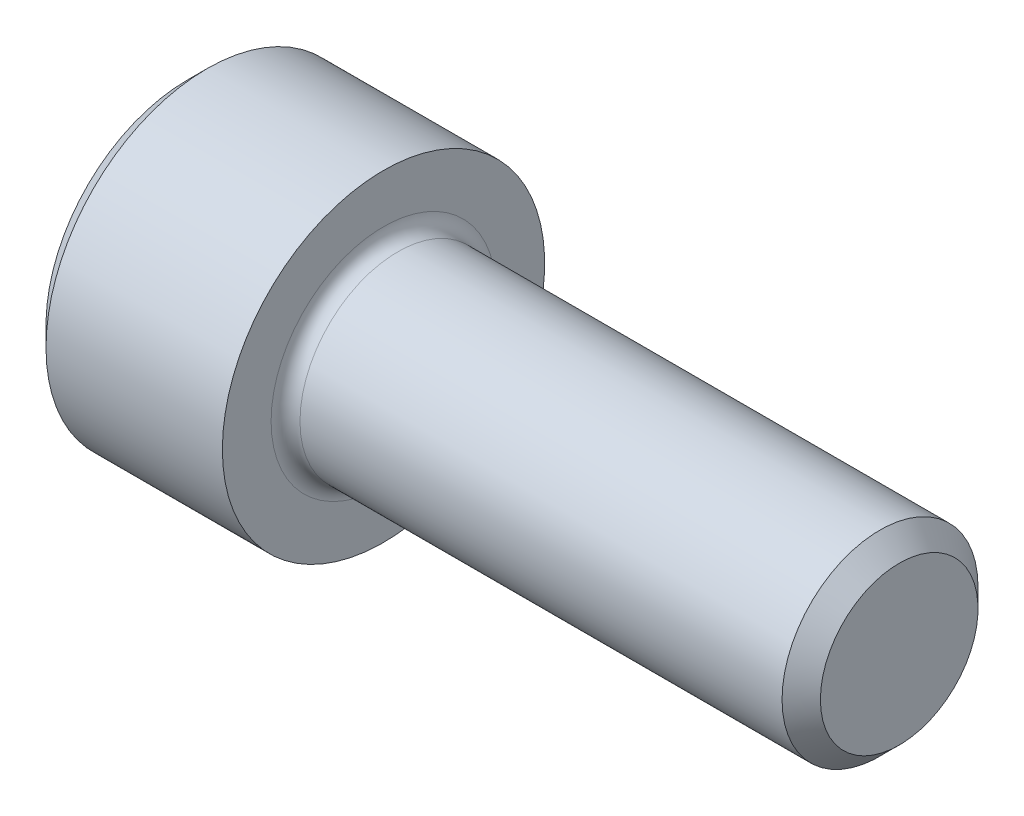
ISO-10303-21;
HEADER;
FILE_DESCRIPTION(('STEP AP214'),'2;1');
FILE_NAME('part.step','',(''),(''),'','','');
FILE_SCHEMA(('AUTOMOTIVE_DESIGN { 1 0 10303 214 1 1 1 1 }'));
ENDSEC;
DATA;
#1=APPLICATION_CONTEXT('core data for automotive mechanical design processes');
#2=APPLICATION_PROTOCOL_DEFINITION('international standard','automotive_design',2000,#1);
#3=PRODUCT_CONTEXT('',#1,'mechanical');
#4=PRODUCT('Part','Part','',(#3));
#5=PRODUCT_RELATED_PRODUCT_CATEGORY('part','',(#4));
#6=PRODUCT_DEFINITION_FORMATION('','',#4);
#7=PRODUCT_DEFINITION_CONTEXT('part definition',#1,'design');
#8=PRODUCT_DEFINITION('design','',#6,#7);
#9=PRODUCT_DEFINITION_SHAPE('','',#8);
#10=(LENGTH_UNIT() NAMED_UNIT(*) SI_UNIT(.MILLI.,.METRE.));
#11=(NAMED_UNIT(*) PLANE_ANGLE_UNIT() SI_UNIT($,.RADIAN.));
#12=(NAMED_UNIT(*) SI_UNIT($,.STERADIAN.) SOLID_ANGLE_UNIT());
#13=UNCERTAINTY_MEASURE_WITH_UNIT(LENGTH_MEASURE(1.E-05),#10,'distance_accuracy_value','');
#14=(GEOMETRIC_REPRESENTATION_CONTEXT(3) GLOBAL_UNCERTAINTY_ASSIGNED_CONTEXT((#13)) GLOBAL_UNIT_ASSIGNED_CONTEXT((#10,
#11,#12)) REPRESENTATION_CONTEXT('',''));
#15=CARTESIAN_POINT('',(0.,0.,0.));
#16=DIRECTION('',(0.,0.,1.));
#17=DIRECTION('',(1.,0.,0.));
#18=AXIS2_PLACEMENT_3D('',#15,#16,#17);
#19=CARTESIAN_POINT('',(2.286,1.14604605784411,1.98501));
#20=DIRECTION('',(-1.,0.,0.));
#21=DIRECTION('',(0.,0.,1.));
#22=AXIS2_PLACEMENT_3D('',#19,#20,#21);
#23=PLANE('',#22);
#24=DIRECTION('',(0.,0.500000000000001,0.866025403784438));
#25=VECTOR('',#24,1.);
#26=CARTESIAN_POINT('',(2.286,-1.71906908676614,0.992505));
#27=LINE('',#26,#25);
#28=CARTESIAN_POINT('',(2.2859999999804,-1.71906908679011,0.992505000013839));
#29=VERTEX_POINT('',#28);
#30=CARTESIAN_POINT('',(2.286,-1.14604605784409,1.98501));
#31=VERTEX_POINT('',#30);
#32=EDGE_CURVE('E108',#29,#31,#27,.T.);
#33=ORIENTED_EDGE('',*,*,#32,.T.);
#34=DIRECTION('',(0.,1.,0.));
#35=VECTOR('',#34,1.);
#36=CARTESIAN_POINT('',(2.286,1.14604605784411,1.98501));
#37=LINE('',#36,#35);
#38=CARTESIAN_POINT('',(2.28599999998701,0.,1.98501000001309));
#39=VERTEX_POINT('',#38);
#40=EDGE_CURVE('E103',#31,#39,#37,.T.);
#41=ORIENTED_EDGE('',*,*,#40,.T.);
#42=CARTESIAN_POINT('',(2.2859999999608,0.,0.));
#43=DIRECTION('',(-1.,0.,0.));
#44=DIRECTION('',(0.,0.,1.));
#45=AXIS2_PLACEMENT_3D('',#42,#43,#44);
#46=CIRCLE('',#45,1.98501000005535);
#47=EDGE_CURVE('E105',#39,#29,#46,.F.);
#48=ORIENTED_EDGE('',*,*,#47,.T.);
#49=EDGE_LOOP('',(#33,#41,#48));
#50=FACE_BOUND('',#49,.T.);
#51=ADVANCED_FACE('F24',(#50),#23,.T.);
#52=CARTESIAN_POINT('',(2.286,1.14604605784411,1.98501));
#53=DIRECTION('',(-1.,0.,0.));
#54=DIRECTION('',(0.,0.,1.));
#55=AXIS2_PLACEMENT_3D('',#52,#53,#54);
#56=PLANE('',#55);
#57=DIRECTION('',(0.,-0.499999999999998,0.86602540378444));
#58=VECTOR('',#57,1.);
#59=CARTESIAN_POINT('',(2.286,-1.71906908676615,-0.992504999999996));
#60=LINE('',#59,#58);
#61=CARTESIAN_POINT('',(2.2859999999804,-1.71906908679012,-0.992505000013836));
#62=VERTEX_POINT('',#61);
#63=CARTESIAN_POINT('',(2.286,-2.29209211568819,0.));
#64=VERTEX_POINT('',#63);
#65=EDGE_CURVE('E112',#62,#64,#60,.T.);
#66=ORIENTED_EDGE('',*,*,#65,.T.);
#67=DIRECTION('',(0.,0.500000000000001,0.866025403784438));
#68=VECTOR('',#67,1.);
#69=CARTESIAN_POINT('',(2.286,-2.29209211568819,0.));
#70=LINE('',#69,#68);
#71=EDGE_CURVE('E179',#64,#29,#70,.T.);
#72=ORIENTED_EDGE('',*,*,#71,.T.);
#73=CARTESIAN_POINT('',(2.2859999999608,0.,0.));
#74=DIRECTION('',(-1.,0.,0.));
#75=DIRECTION('',(0.,0.,1.));
#76=AXIS2_PLACEMENT_3D('',#73,#74,#75);
#77=CIRCLE('',#76,1.98501000005535);
#78=EDGE_CURVE('E124',#29,#62,#77,.F.);
#79=ORIENTED_EDGE('',*,*,#78,.T.);
#80=EDGE_LOOP('',(#66,#72,#79));
#81=FACE_BOUND('',#80,.T.);
#82=ADVANCED_FACE('F355',(#81),#56,.T.);
#83=CARTESIAN_POINT('',(2.286,1.14604605784411,1.98501));
#84=DIRECTION('',(-1.,0.,0.));
#85=DIRECTION('',(0.,0.,1.));
#86=AXIS2_PLACEMENT_3D('',#83,#84,#85);
#87=PLANE('',#86);
#88=DIRECTION('',(0.,1.,0.));
#89=VECTOR('',#88,1.);
#90=CARTESIAN_POINT('',(2.286,1.14604605784411,-1.98501));
#91=LINE('',#90,#89);
#92=CARTESIAN_POINT('',(2.28599999998701,0.,-1.98501000001309));
#93=VERTEX_POINT('',#92);
#94=CARTESIAN_POINT('',(2.286,-1.1460460578441,-1.98501));
#95=VERTEX_POINT('',#94);
#96=EDGE_CURVE('E174',#93,#95,#91,.F.);
#97=ORIENTED_EDGE('',*,*,#96,.T.);
#98=DIRECTION('',(0.,-0.499999999999999,0.866025403784439));
#99=VECTOR('',#98,1.);
#100=CARTESIAN_POINT('',(2.286,-1.1460460578441,-1.98501));
#101=LINE('',#100,#99);
#102=EDGE_CURVE('E169',#95,#62,#101,.T.);
#103=ORIENTED_EDGE('',*,*,#102,.T.);
#104=CARTESIAN_POINT('',(2.2859999999608,0.,0.));
#105=DIRECTION('',(-1.,0.,0.));
#106=DIRECTION('',(0.,0.,1.));
#107=AXIS2_PLACEMENT_3D('',#104,#105,#106);
#108=CIRCLE('',#107,1.98501000005535);
#109=EDGE_CURVE('E232',#62,#93,#108,.F.);
#110=ORIENTED_EDGE('',*,*,#109,.T.);
#111=EDGE_LOOP('',(#97,#103,#110));
#112=FACE_BOUND('',#111,.T.);
#113=ADVANCED_FACE('F352',(#112),#87,.T.);
#114=CARTESIAN_POINT('',(2.286,1.14604605784411,1.98501));
#115=DIRECTION('',(-1.,0.,0.));
#116=DIRECTION('',(0.,0.,1.));
#117=AXIS2_PLACEMENT_3D('',#114,#115,#116);
#118=PLANE('',#117);
#119=DIRECTION('',(0.,-0.500000000000001,-0.866025403784438));
#120=VECTOR('',#119,1.);
#121=CARTESIAN_POINT('',(2.286,1.71906908676615,-0.992505000000006));
#122=LINE('',#121,#120);
#123=CARTESIAN_POINT('',(2.2859999999804,1.71906908679012,-0.992505000013843));
#124=VERTEX_POINT('',#123);
#125=CARTESIAN_POINT('',(2.286,1.1460460578441,-1.98501));
#126=VERTEX_POINT('',#125);
#127=EDGE_CURVE('E164',#124,#126,#122,.T.);
#128=ORIENTED_EDGE('',*,*,#127,.T.);
#129=DIRECTION('',(0.,1.,0.));
#130=VECTOR('',#129,1.);
#131=CARTESIAN_POINT('',(2.286,1.14604605784411,-1.98501));
#132=LINE('',#131,#130);
#133=EDGE_CURVE('E159',#126,#93,#132,.F.);
#134=ORIENTED_EDGE('',*,*,#133,.T.);
#135=CARTESIAN_POINT('',(2.2859999999608,0.,0.));
#136=DIRECTION('',(-1.,0.,0.));
#137=DIRECTION('',(0.,0.,1.));
#138=AXIS2_PLACEMENT_3D('',#135,#136,#137);
#139=CIRCLE('',#138,1.98501000005535);
#140=EDGE_CURVE('E229',#93,#124,#139,.F.);
#141=ORIENTED_EDGE('',*,*,#140,.T.);
#142=EDGE_LOOP('',(#128,#134,#141));
#143=FACE_BOUND('',#142,.T.);
#144=ADVANCED_FACE('F348',(#143),#118,.T.);
#145=CARTESIAN_POINT('',(2.286,1.14604605784411,1.98501));
#146=DIRECTION('',(-1.,0.,0.));
#147=DIRECTION('',(0.,0.,1.));
#148=AXIS2_PLACEMENT_3D('',#145,#146,#147);
#149=PLANE('',#148);
#150=DIRECTION('',(0.,0.500000000000002,-0.866025403784437));
#151=VECTOR('',#150,1.);
#152=CARTESIAN_POINT('',(2.286,1.71906908676615,0.992504999999996));
#153=LINE('',#152,#151);
#154=CARTESIAN_POINT('',(2.2859999999804,1.71906908679012,0.992505000013835));
#155=VERTEX_POINT('',#154);
#156=CARTESIAN_POINT('',(2.286,2.2920921156882,0.));
#157=VERTEX_POINT('',#156);
#158=EDGE_CURVE('E154',#155,#157,#153,.T.);
#159=ORIENTED_EDGE('',*,*,#158,.T.);
#160=DIRECTION('',(0.,-0.500000000000002,-0.866025403784437));
#161=VECTOR('',#160,1.);
#162=CARTESIAN_POINT('',(2.286,2.2920921156882,0.));
#163=LINE('',#162,#161);
#164=EDGE_CURVE('E125',#157,#124,#163,.T.);
#165=ORIENTED_EDGE('',*,*,#164,.T.);
#166=CARTESIAN_POINT('',(2.2859999999608,0.,0.));
#167=DIRECTION('',(-1.,0.,0.));
#168=DIRECTION('',(0.,0.,1.));
#169=AXIS2_PLACEMENT_3D('',#166,#167,#168);
#170=CIRCLE('',#169,1.98501000005535);
#171=EDGE_CURVE('E132',#124,#155,#170,.F.);
#172=ORIENTED_EDGE('',*,*,#171,.T.);
#173=EDGE_LOOP('',(#159,#165,#172));
#174=FACE_BOUND('',#173,.T.);
#175=ADVANCED_FACE('F344',(#174),#149,.T.);
#176=CARTESIAN_POINT('',(2.28600000002643,0.,0.));
#177=DIRECTION('',(-1.,0.,0.));
#178=DIRECTION('',(0.,0.,1.));
#179=AXIS2_PLACEMENT_3D('',#176,#177,#178);
#180=CONICAL_SURFACE('',#179,1.98500999994167,1.04719755112655);
#181=CARTESIAN_POINT('',(3.43204605781011,0.,5.6843418860808E-11));
#182=VERTEX_POINT('',#181);
#183=VERTEX_LOOP('',#182);
#184=FACE_BOUND('',#183,.T.);
#185=ORIENTED_EDGE('',*,*,#47,.F.);
#186=CARTESIAN_POINT('',(2.2859999999608,0.,0.));
#187=DIRECTION('',(-1.,0.,0.));
#188=DIRECTION('',(0.,0.,1.));
#189=AXIS2_PLACEMENT_3D('',#186,#187,#188);
#190=CIRCLE('',#189,1.98501000005535);
#191=EDGE_CURVE('E120',#155,#39,#190,.F.);
#192=ORIENTED_EDGE('',*,*,#191,.F.);
#193=ORIENTED_EDGE('',*,*,#171,.F.);
#194=ORIENTED_EDGE('',*,*,#140,.F.);
#195=ORIENTED_EDGE('',*,*,#109,.F.);
#196=ORIENTED_EDGE('',*,*,#78,.F.);
#197=EDGE_LOOP('',(#185,#192,#193,#194,#195,#196));
#198=FACE_BOUND('',#197,.T.);
#199=ADVANCED_FACE('F118',(#184,#198),#180,.F.);
#200=CARTESIAN_POINT('',(2.286,1.14604605784411,1.98501));
#201=DIRECTION('',(-1.,0.,0.));
#202=DIRECTION('',(0.,0.,1.));
#203=AXIS2_PLACEMENT_3D('',#200,#201,#202);
#204=PLANE('',#203);
#205=DIRECTION('',(0.,-1.,0.));
#206=VECTOR('',#205,1.);
#207=CARTESIAN_POINT('',(2.286,-1.14604605784409,1.98501));
#208=LINE('',#207,#206);
#209=CARTESIAN_POINT('',(2.286,1.14604605784411,1.98501));
#210=VERTEX_POINT('',#209);
#211=EDGE_CURVE('E129',#39,#210,#208,.F.);
#212=ORIENTED_EDGE('',*,*,#211,.T.);
#213=DIRECTION('',(0.,0.499999999999998,-0.86602540378444));
#214=VECTOR('',#213,1.);
#215=CARTESIAN_POINT('',(2.286,2.2920921156882,0.));
#216=LINE('',#215,#214);
#217=EDGE_CURVE('E131',#155,#210,#216,.F.);
#218=ORIENTED_EDGE('',*,*,#217,.F.);
#219=ORIENTED_EDGE('',*,*,#191,.T.);
#220=EDGE_LOOP('',(#212,#218,#219));
#221=FACE_BOUND('',#220,.T.);
#222=ADVANCED_FACE('F128',(#221),#204,.T.);
#223=CARTESIAN_POINT('',(2.286,2.2920921156882,0.));
#224=DIRECTION('',(0.,-0.86602540378444,-0.499999999999998));
#225=DIRECTION('',(0.,0.499999999999998,-0.86602540378444));
#226=AXIS2_PLACEMENT_3D('',#223,#224,#225);
#227=PLANE('',#226);
#228=ORIENTED_EDGE('',*,*,#217,.T.);
#229=DIRECTION('',(1.,0.,0.));
#230=VECTOR('',#229,1.);
#231=CARTESIAN_POINT('',(2.286,1.14604605784411,1.98501));
#232=LINE('',#231,#230);
#233=CARTESIAN_POINT('',(0.,1.14604605784411,1.98501));
#234=VERTEX_POINT('',#233);
#235=EDGE_CURVE('E137',#210,#234,#232,.F.);
#236=ORIENTED_EDGE('',*,*,#235,.T.);
#237=DIRECTION('',(0.,-0.499999999999998,0.86602540378444));
#238=VECTOR('',#237,1.);
#239=CARTESIAN_POINT('',(0.,2.2920921156882,0.));
#240=LINE('',#239,#238);
#241=CARTESIAN_POINT('',(0.,2.2920921156882,0.));
#242=VERTEX_POINT('',#241);
#243=EDGE_CURVE('E144',#242,#234,#240,.T.);
#244=ORIENTED_EDGE('',*,*,#243,.F.);
#245=DIRECTION('',(1.,0.,0.));
#246=VECTOR('',#245,1.);
#247=CARTESIAN_POINT('',(2.286,2.2920921156882,0.));
#248=LINE('',#247,#246);
#249=EDGE_CURVE('E194',#242,#157,#248,.T.);
#250=ORIENTED_EDGE('',*,*,#249,.T.);
#251=ORIENTED_EDGE('',*,*,#158,.F.);
#252=EDGE_LOOP('',(#228,#236,#244,#250,#251));
#253=FACE_BOUND('',#252,.T.);
#254=ADVANCED_FACE('F336',(#253),#227,.T.);
#255=CARTESIAN_POINT('',(2.286,-1.14604605784409,1.98501));
#256=DIRECTION('',(0.,0.,1.));
#257=DIRECTION('',(0.,-1.,0.));
#258=AXIS2_PLACEMENT_3D('',#255,#256,#257);
#259=PLANE('',#258);
#260=ORIENTED_EDGE('',*,*,#235,.F.);
#261=ORIENTED_EDGE('',*,*,#211,.F.);
#262=ORIENTED_EDGE('',*,*,#40,.F.);
#263=DIRECTION('',(1.,0.,0.));
#264=VECTOR('',#263,1.);
#265=CARTESIAN_POINT('',(2.286,-1.14604605784409,1.98501));
#266=LINE('',#265,#264);
#267=CARTESIAN_POINT('',(0.,-1.14604605784409,1.98501));
#268=VERTEX_POINT('',#267);
#269=EDGE_CURVE('E139',#268,#31,#266,.T.);
#270=ORIENTED_EDGE('',*,*,#269,.F.);
#271=DIRECTION('',(0.,1.,0.));
#272=VECTOR('',#271,1.);
#273=CARTESIAN_POINT('',(0.,0.,1.98501));
#274=LINE('',#273,#272);
#275=EDGE_CURVE('E371',#234,#268,#274,.F.);
#276=ORIENTED_EDGE('',*,*,#275,.F.);
#277=EDGE_LOOP('',(#260,#261,#262,#270,#276));
#278=FACE_BOUND('',#277,.T.);
#279=ADVANCED_FACE('F135',(#278),#259,.F.);
#280=CARTESIAN_POINT('',(2.286,-1.14604605784409,1.98501));
#281=DIRECTION('',(0.,0.866025403784438,-0.500000000000001));
#282=DIRECTION('',(0.,0.500000000000001,0.866025403784438));
#283=AXIS2_PLACEMENT_3D('',#280,#281,#282);
#284=PLANE('',#283);
#285=ORIENTED_EDGE('',*,*,#71,.F.);
#286=DIRECTION('',(1.,0.,0.));
#287=VECTOR('',#286,1.);
#288=CARTESIAN_POINT('',(2.286,-2.29209211568819,0.));
#289=LINE('',#288,#287);
#290=CARTESIAN_POINT('',(0.,-2.29209211568819,0.));
#291=VERTEX_POINT('',#290);
#292=EDGE_CURVE('E205',#291,#64,#289,.T.);
#293=ORIENTED_EDGE('',*,*,#292,.F.);
#294=DIRECTION('',(0.,-0.500000000000001,-0.866025403784438));
#295=VECTOR('',#294,1.);
#296=CARTESIAN_POINT('',(0.,-1.14604605784409,1.98501));
#297=LINE('',#296,#295);
#298=EDGE_CURVE('E369',#268,#291,#297,.T.);
#299=ORIENTED_EDGE('',*,*,#298,.F.);
#300=ORIENTED_EDGE('',*,*,#269,.T.);
#301=ORIENTED_EDGE('',*,*,#32,.F.);
#302=EDGE_LOOP('',(#285,#293,#299,#300,#301));
#303=FACE_BOUND('',#302,.T.);
#304=ADVANCED_FACE('F329',(#303),#284,.T.);
#305=CARTESIAN_POINT('',(2.286,-2.29209211568819,0.));
#306=DIRECTION('',(0.,0.866025403784439,0.499999999999999));
#307=DIRECTION('',(0.,-0.499999999999999,0.866025403784439));
#308=AXIS2_PLACEMENT_3D('',#305,#306,#307);
#309=PLANE('',#308);
#310=ORIENTED_EDGE('',*,*,#102,.F.);
#311=DIRECTION('',(1.,0.,0.));
#312=VECTOR('',#311,1.);
#313=CARTESIAN_POINT('',(2.286,-1.1460460578441,-1.98501));
#314=LINE('',#313,#312);
#315=CARTESIAN_POINT('',(0.,-1.1460460578441,-1.98501));
#316=VERTEX_POINT('',#315);
#317=EDGE_CURVE('E198',#95,#316,#314,.F.);
#318=ORIENTED_EDGE('',*,*,#317,.T.);
#319=DIRECTION('',(0.,0.499999999999999,-0.86602540378444));
#320=VECTOR('',#319,1.);
#321=CARTESIAN_POINT('',(0.,-2.29209211568819,0.));
#322=LINE('',#321,#320);
#323=EDGE_CURVE('E366',#291,#316,#322,.T.);
#324=ORIENTED_EDGE('',*,*,#323,.F.);
#325=ORIENTED_EDGE('',*,*,#292,.T.);
#326=ORIENTED_EDGE('',*,*,#65,.F.);
#327=EDGE_LOOP('',(#310,#318,#324,#325,#326));
#328=FACE_BOUND('',#327,.T.);
#329=ADVANCED_FACE('F325',(#328),#309,.T.);
#330=CARTESIAN_POINT('',(2.286,1.1460460578441,-1.98501));
#331=DIRECTION('',(0.,0.,-1.));
#332=DIRECTION('',(0.,1.,0.));
#333=AXIS2_PLACEMENT_3D('',#330,#331,#332);
#334=PLANE('',#333);
#335=ORIENTED_EDGE('',*,*,#317,.F.);
#336=ORIENTED_EDGE('',*,*,#96,.F.);
#337=ORIENTED_EDGE('',*,*,#133,.F.);
#338=DIRECTION('',(1.,0.,0.));
#339=VECTOR('',#338,1.);
#340=CARTESIAN_POINT('',(2.286,1.1460460578441,-1.98501));
#341=LINE('',#340,#339);
#342=CARTESIAN_POINT('',(0.,1.1460460578441,-1.98501));
#343=VERTEX_POINT('',#342);
#344=EDGE_CURVE('E197',#126,#343,#341,.F.);
#345=ORIENTED_EDGE('',*,*,#344,.T.);
#346=DIRECTION('',(0.,1.,0.));
#347=VECTOR('',#346,1.);
#348=CARTESIAN_POINT('',(0.,0.,-1.98501));
#349=LINE('',#348,#347);
#350=EDGE_CURVE('E381',#316,#343,#349,.T.);
#351=ORIENTED_EDGE('',*,*,#350,.F.);
#352=EDGE_LOOP('',(#335,#336,#337,#345,#351));
#353=FACE_BOUND('',#352,.T.);
#354=ADVANCED_FACE('F321',(#353),#334,.F.);
#355=CARTESIAN_POINT('',(2.286,2.2920921156882,0.));
#356=DIRECTION('',(0.,0.866025403784438,-0.500000000000002));
#357=DIRECTION('',(0.,0.500000000000002,0.866025403784438));
#358=AXIS2_PLACEMENT_3D('',#355,#356,#357);
#359=PLANE('',#358);
#360=ORIENTED_EDGE('',*,*,#344,.F.);
#361=ORIENTED_EDGE('',*,*,#127,.F.);
#362=ORIENTED_EDGE('',*,*,#164,.F.);
#363=ORIENTED_EDGE('',*,*,#249,.F.);
#364=DIRECTION('',(0.,0.500000000000002,0.866025403784438));
#365=VECTOR('',#364,1.);
#366=CARTESIAN_POINT('',(0.,1.1460460578441,-1.98501));
#367=LINE('',#366,#365);
#368=EDGE_CURVE('E225',#343,#242,#367,.T.);
#369=ORIENTED_EDGE('',*,*,#368,.F.);
#370=EDGE_LOOP('',(#360,#361,#362,#363,#369));
#371=FACE_BOUND('',#370,.T.);
#372=ADVANCED_FACE('F317',(#371),#359,.F.);
#373=CARTESIAN_POINT('',(0.,0.,0.));
#374=DIRECTION('',(-1.,0.,0.));
#375=DIRECTION('',(0.,0.,1.));
#376=AXIS2_PLACEMENT_3D('',#373,#374,#375);
#377=PLANE('',#376);
#378=CARTESIAN_POINT('',(-5.6843418860808E-11,0.,0.));
#379=DIRECTION('',(1.,0.,0.));
#380=DIRECTION('',(0.,1.,0.));
#381=AXIS2_PLACEMENT_3D('',#378,#379,#380);
#382=CIRCLE('',#381,3.48615000001473);
#383=CARTESIAN_POINT('',(-5.68434426698877E-11,3.48615000001473,0.));
#384=VERTEX_POINT('',#383);
#385=EDGE_CURVE('E223',#384,#384,#382,.T.);
#386=ORIENTED_EDGE('',*,*,#385,.F.);
#387=EDGE_LOOP('',(#386));
#388=FACE_BOUND('',#387,.T.);
#389=ORIENTED_EDGE('',*,*,#350,.T.);
#390=ORIENTED_EDGE('',*,*,#368,.T.);
#391=ORIENTED_EDGE('',*,*,#243,.T.);
#392=ORIENTED_EDGE('',*,*,#275,.T.);
#393=ORIENTED_EDGE('',*,*,#298,.T.);
#394=ORIENTED_EDGE('',*,*,#323,.T.);
#395=EDGE_LOOP('',(#389,#390,#391,#392,#393,#394));
#396=FACE_BOUND('',#395,.T.);
#397=ADVANCED_FACE('F309',(#388,#396),#377,.T.);
#398=CARTESIAN_POINT('',(0.482599999998001,0.,0.));
#399=DIRECTION('',(1.,0.,0.));
#400=DIRECTION('',(0.,1.,0.));
#401=AXIS2_PLACEMENT_3D('',#398,#399,#400);
#402=CONICAL_SURFACE('',#401,3.96875000006958,0.785398163397448);
#403=ORIENTED_EDGE('',*,*,#385,.T.);
#404=EDGE_LOOP('',(#403));
#405=FACE_BOUND('',#404,.T.);
#406=CARTESIAN_POINT('',(0.4826,0.,0.));
#407=DIRECTION('',(-1.,0.,0.));
#408=DIRECTION('',(0.,0.,1.));
#409=AXIS2_PLACEMENT_3D('',#406,#407,#408);
#410=CIRCLE('',#409,3.96875);
#411=CARTESIAN_POINT('',(0.4826,0.,3.96875));
#412=VERTEX_POINT('',#411);
#413=EDGE_CURVE('E222',#412,#412,#410,.F.);
#414=ORIENTED_EDGE('',*,*,#413,.F.);
#415=EDGE_LOOP('',(#414));
#416=FACE_BOUND('',#415,.T.);
#417=ADVANCED_FACE('F304',(#405,#416),#402,.T.);
#418=CARTESIAN_POINT('',(-31.75,0.,0.));
#419=DIRECTION('',(-1.,0.,0.));
#420=DIRECTION('',(0.,0.,1.));
#421=AXIS2_PLACEMENT_3D('',#418,#419,#420);
#422=CYLINDRICAL_SURFACE('',#421,3.96875);
#423=CARTESIAN_POINT('',(4.826,0.,0.));
#424=DIRECTION('',(-1.,0.,0.));
#425=DIRECTION('',(0.,0.,1.));
#426=AXIS2_PLACEMENT_3D('',#423,#424,#425);
#427=CIRCLE('',#426,3.96875);
#428=CARTESIAN_POINT('',(4.826,0.,3.96875));
#429=VERTEX_POINT('',#428);
#430=EDGE_CURVE('E219',#429,#429,#427,.F.);
#431=ORIENTED_EDGE('',*,*,#430,.F.);
#432=EDGE_LOOP('',(#431));
#433=FACE_BOUND('',#432,.T.);
#434=ORIENTED_EDGE('',*,*,#413,.T.);
#435=EDGE_LOOP('',(#434));
#436=FACE_BOUND('',#435,.T.);
#437=ADVANCED_FACE('F300',(#433,#436),#422,.T.);
#438=CARTESIAN_POINT('',(17.526,1.94056,0.));
#439=DIRECTION('',(1.,0.,0.));
#440=DIRECTION('',(0.,0.,-1.));
#441=AXIS2_PLACEMENT_3D('',#438,#439,#440);
#442=PLANE('',#441);
#443=CARTESIAN_POINT('',(17.5259999999753,0.,0.));
#444=DIRECTION('',(-1.,0.,0.));
#445=DIRECTION('',(0.,0.,1.));
#446=AXIS2_PLACEMENT_3D('',#443,#444,#445);
#447=CIRCLE('',#446,1.94055999998);
#448=CARTESIAN_POINT('',(17.5259999999753,0.,1.94055999998));
#449=VERTEX_POINT('',#448);
#450=EDGE_CURVE('E215',#449,#449,#447,.T.);
#451=ORIENTED_EDGE('',*,*,#450,.F.);
#452=EDGE_LOOP('',(#451));
#453=FACE_BOUND('',#452,.T.);
#454=ADVANCED_FACE('F258',(#453),#442,.T.);
#455=CARTESIAN_POINT('',(4.826,3.96875,0.));
#456=DIRECTION('',(1.,0.,0.));
#457=DIRECTION('',(0.,0.,-1.));
#458=AXIS2_PLACEMENT_3D('',#455,#456,#457);
#459=PLANE('',#458);
#460=ORIENTED_EDGE('',*,*,#430,.T.);
#461=EDGE_LOOP('',(#460));
#462=FACE_BOUND('',#461,.T.);
#463=CARTESIAN_POINT('',(4.826,0.,0.));
#464=DIRECTION('',(1.,0.,0.));
#465=DIRECTION('',(0.,0.,1.));
#466=AXIS2_PLACEMENT_3D('',#463,#464,#465);
#467=CIRCLE('',#466,2.76859999999999);
#468=CARTESIAN_POINT('',(4.826,0.,-2.76859999999999));
#469=VERTEX_POINT('',#468);
#470=CARTESIAN_POINT('',(4.826,0.,2.76859999999999));
#471=VERTEX_POINT('',#470);
#472=EDGE_CURVE('E218',#469,#471,#467,.F.);
#473=ORIENTED_EDGE('',*,*,#472,.T.);
#474=CARTESIAN_POINT('',(4.826,0.,0.));
#475=DIRECTION('',(1.,0.,0.));
#476=DIRECTION('',(0.,0.,-1.));
#477=AXIS2_PLACEMENT_3D('',#474,#475,#476);
#478=CIRCLE('',#477,2.76859999999999);
#479=EDGE_CURVE('E43',#471,#469,#478,.F.);
#480=ORIENTED_EDGE('',*,*,#479,.T.);
#481=EDGE_LOOP('',(#473,#480));
#482=FACE_BOUND('',#481,.T.);
#483=ADVANCED_FACE('F239',(#462,#482),#459,.T.);
#484=CARTESIAN_POINT('',(17.0535599999084,0.,0.));
#485=DIRECTION('',(-1.,0.,0.));
#486=DIRECTION('',(0.,0.,1.));
#487=AXIS2_PLACEMENT_3D('',#484,#485,#486);
#488=CONICAL_SURFACE('',#487,2.41299999999001,0.785398163337289);
#489=CARTESIAN_POINT('',(17.05356,0.,0.));
#490=DIRECTION('',(-1.,0.,0.));
#491=DIRECTION('',(0.,0.,1.));
#492=AXIS2_PLACEMENT_3D('',#489,#490,#491);
#493=CIRCLE('',#492,2.41299999999999);
#494=CARTESIAN_POINT('',(17.05356,0.,2.41299999999999));
#495=VERTEX_POINT('',#494);
#496=EDGE_CURVE('E35',#495,#495,#493,.T.);
#497=ORIENTED_EDGE('',*,*,#496,.F.);
#498=EDGE_LOOP('',(#497));
#499=FACE_BOUND('',#498,.T.);
#500=ORIENTED_EDGE('',*,*,#450,.T.);
#501=EDGE_LOOP('',(#500));
#502=FACE_BOUND('',#501,.T.);
#503=ADVANCED_FACE('F257',(#499,#502),#488,.T.);
#504=CARTESIAN_POINT('',(5.1816,0.,0.));
#505=DIRECTION('',(1.,0.,0.));
#506=DIRECTION('',(0.,0.,-1.));
#507=AXIS2_PLACEMENT_3D('',#504,#505,#506);
#508=TOROIDAL_SURFACE('',#507,2.76859999999999,0.3556);
#509=CARTESIAN_POINT('',(5.1816,0.,0.));
#510=DIRECTION('',(-1.,0.,0.));
#511=DIRECTION('',(0.,0.,1.));
#512=AXIS2_PLACEMENT_3D('',#509,#510,#511);
#513=CIRCLE('',#512,2.41299999999999);
#514=CARTESIAN_POINT('',(5.1816,0.,2.41299999999999));
#515=VERTEX_POINT('',#514);
#516=EDGE_CURVE('E13',#515,#515,#513,.F.);
#517=ORIENTED_EDGE('',*,*,#516,.F.);
#518=EDGE_LOOP('',(#517));
#519=FACE_BOUND('',#518,.T.);
#520=ORIENTED_EDGE('',*,*,#472,.F.);
#521=ORIENTED_EDGE('',*,*,#479,.F.);
#522=EDGE_LOOP('',(#520,#521));
#523=FACE_BOUND('',#522,.T.);
#524=ADVANCED_FACE('F236',(#519,#523),#508,.F.);
#525=CARTESIAN_POINT('',(-31.75,0.,0.));
#526=DIRECTION('',(-1.,0.,0.));
#527=DIRECTION('',(0.,0.,1.));
#528=AXIS2_PLACEMENT_3D('',#525,#526,#527);
#529=CYLINDRICAL_SURFACE('',#528,2.41299999999999);
#530=ORIENTED_EDGE('',*,*,#516,.T.);
#531=EDGE_LOOP('',(#530));
#532=FACE_BOUND('',#531,.T.);
#533=ORIENTED_EDGE('',*,*,#496,.T.);
#534=EDGE_LOOP('',(#533));
#535=FACE_BOUND('',#534,.T.);
#536=ADVANCED_FACE('F282',(#532,#535),#529,.T.);
#537=CLOSED_SHELL('',(#51,#82,#113,#144,#175,#199,#222,#254,#279,#304,#329,#354,#372,#397,#417,
#437,#454,#483,#503,#524,#536));
#538=MANIFOLD_SOLID_BREP('B1',#537);
#539=ADVANCED_BREP_SHAPE_REPRESENTATION('',(#18,#538),#14);
#540=SHAPE_DEFINITION_REPRESENTATION(#9,#539);
ENDSEC;
END-ISO-10303-21;
